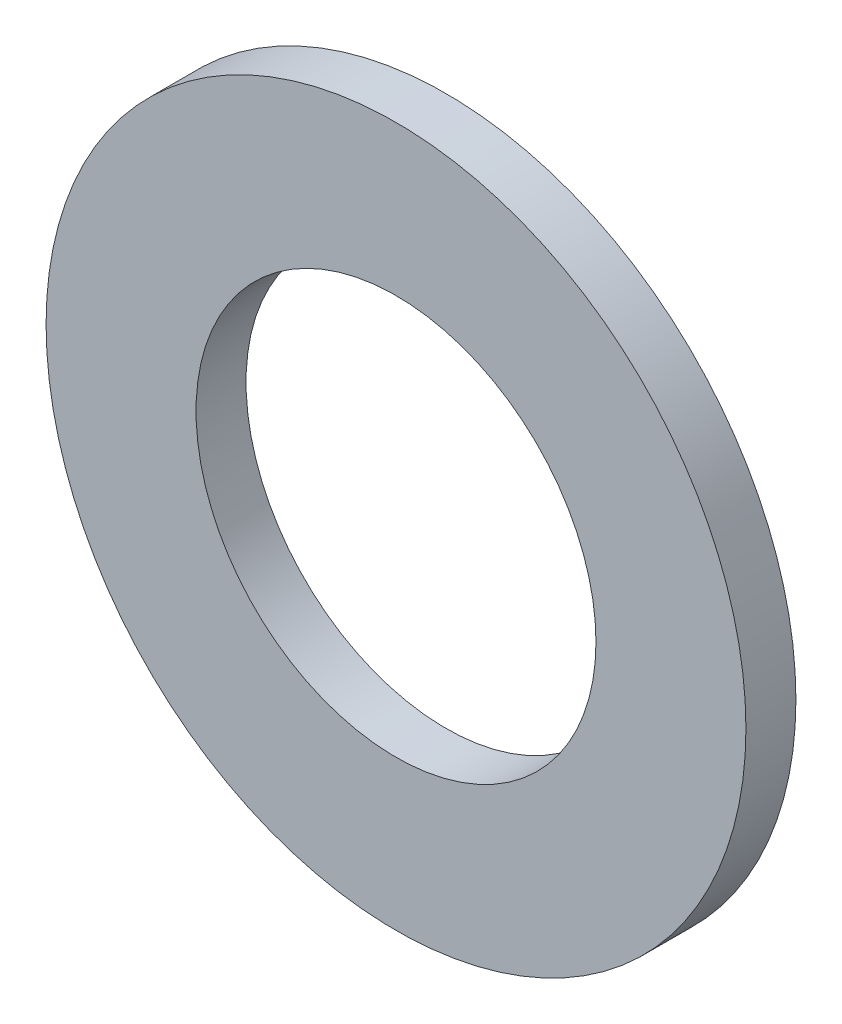
ISO-10303-21;
HEADER;
FILE_DESCRIPTION(('STEP AP214'),'2;1');
FILE_NAME('part.step','',(''),(''),'','','');
FILE_SCHEMA(('AUTOMOTIVE_DESIGN { 1 0 10303 214 1 1 1 1 }'));
ENDSEC;
DATA;
#1=APPLICATION_CONTEXT('core data for automotive mechanical design processes');
#2=APPLICATION_PROTOCOL_DEFINITION('international standard','automotive_design',2000,#1);
#3=PRODUCT_CONTEXT('',#1,'mechanical');
#4=PRODUCT('Part','Part','',(#3));
#5=PRODUCT_RELATED_PRODUCT_CATEGORY('part','',(#4));
#6=PRODUCT_DEFINITION_FORMATION('','',#4);
#7=PRODUCT_DEFINITION_CONTEXT('part definition',#1,'design');
#8=PRODUCT_DEFINITION('design','',#6,#7);
#9=PRODUCT_DEFINITION_SHAPE('','',#8);
#10=(LENGTH_UNIT() NAMED_UNIT(*) SI_UNIT(.MILLI.,.METRE.));
#11=(NAMED_UNIT(*) PLANE_ANGLE_UNIT() SI_UNIT($,.RADIAN.));
#12=(NAMED_UNIT(*) SI_UNIT($,.STERADIAN.) SOLID_ANGLE_UNIT());
#13=UNCERTAINTY_MEASURE_WITH_UNIT(LENGTH_MEASURE(1.E-05),#10,'distance_accuracy_value','');
#14=(GEOMETRIC_REPRESENTATION_CONTEXT(3) GLOBAL_UNCERTAINTY_ASSIGNED_CONTEXT((#13)) GLOBAL_UNIT_ASSIGNED_CONTEXT((#10,
#11,#12)) REPRESENTATION_CONTEXT('',''));
#15=CARTESIAN_POINT('',(0.,0.,0.));
#16=DIRECTION('',(0.,0.,1.));
#17=DIRECTION('',(1.,0.,0.));
#18=AXIS2_PLACEMENT_3D('',#15,#16,#17);
#19=CARTESIAN_POINT('',(0.,0.,0.));
#20=DIRECTION('',(0.,0.,1.));
#21=DIRECTION('',(1.,0.,0.));
#22=AXIS2_PLACEMENT_3D('',#19,#20,#21);
#23=PLANE('',#22);
#24=CARTESIAN_POINT('',(0.,0.,0.));
#25=DIRECTION('',(0.,0.,1.));
#26=DIRECTION('',(1.,0.,0.));
#27=AXIS2_PLACEMENT_3D('',#24,#25,#26);
#28=CIRCLE('',#27,4.);
#29=CARTESIAN_POINT('',(4.,0.,0.));
#30=VERTEX_POINT('',#29);
#31=EDGE_CURVE('E26',#30,#30,#28,.T.);
#32=ORIENTED_EDGE('',*,*,#31,.T.);
#33=EDGE_LOOP('',(#32));
#34=FACE_BOUND('',#33,.T.);
#35=CARTESIAN_POINT('',(0.,0.,0.));
#36=DIRECTION('',(0.,0.,1.));
#37=DIRECTION('',(1.,0.,0.));
#38=AXIS2_PLACEMENT_3D('',#35,#36,#37);
#39=CIRCLE('',#38,6.99999999999999);
#40=CARTESIAN_POINT('',(6.99999999999999,0.,0.));
#41=VERTEX_POINT('',#40);
#42=EDGE_CURVE('E17',#41,#41,#39,.T.);
#43=ORIENTED_EDGE('',*,*,#42,.F.);
#44=EDGE_LOOP('',(#43));
#45=FACE_BOUND('',#44,.T.);
#46=ADVANCED_FACE('F14',(#34,#45),#23,.F.);
#47=CARTESIAN_POINT('',(0.,0.,0.));
#48=DIRECTION('',(0.,0.,1.));
#49=DIRECTION('',(1.,0.,0.));
#50=AXIS2_PLACEMENT_3D('',#47,#48,#49);
#51=CYLINDRICAL_SURFACE('',#50,6.99999999999999);
#52=ORIENTED_EDGE('',*,*,#42,.T.);
#53=EDGE_LOOP('',(#52));
#54=FACE_BOUND('',#53,.T.);
#55=CARTESIAN_POINT('',(0.,0.,1.));
#56=DIRECTION('',(0.,0.,1.));
#57=DIRECTION('',(1.,0.,0.));
#58=AXIS2_PLACEMENT_3D('',#55,#56,#57);
#59=CIRCLE('',#58,6.99999999999999);
#60=CARTESIAN_POINT('',(6.99999999999999,0.,1.));
#61=VERTEX_POINT('',#60);
#62=EDGE_CURVE('E21',#61,#61,#59,.T.);
#63=ORIENTED_EDGE('',*,*,#62,.F.);
#64=EDGE_LOOP('',(#63));
#65=FACE_BOUND('',#64,.T.);
#66=ADVANCED_FACE('F34',(#54,#65),#51,.T.);
#67=CARTESIAN_POINT('',(0.,0.,0.));
#68=DIRECTION('',(0.,0.,1.));
#69=DIRECTION('',(1.,0.,0.));
#70=AXIS2_PLACEMENT_3D('',#67,#68,#69);
#71=CYLINDRICAL_SURFACE('',#70,4.);
#72=ORIENTED_EDGE('',*,*,#31,.F.);
#73=EDGE_LOOP('',(#72));
#74=FACE_BOUND('',#73,.T.);
#75=CARTESIAN_POINT('',(0.,0.,1.));
#76=DIRECTION('',(0.,0.,1.));
#77=DIRECTION('',(1.,0.,0.));
#78=AXIS2_PLACEMENT_3D('',#75,#76,#77);
#79=CIRCLE('',#78,4.);
#80=CARTESIAN_POINT('',(4.,0.,1.));
#81=VERTEX_POINT('',#80);
#82=EDGE_CURVE('E10',#81,#81,#79,.F.);
#83=ORIENTED_EDGE('',*,*,#82,.F.);
#84=EDGE_LOOP('',(#83));
#85=FACE_BOUND('',#84,.T.);
#86=ADVANCED_FACE('F42',(#74,#85),#71,.F.);
#87=CARTESIAN_POINT('',(0.,0.,1.));
#88=DIRECTION('',(0.,0.,1.));
#89=DIRECTION('',(1.,0.,0.));
#90=AXIS2_PLACEMENT_3D('',#87,#88,#89);
#91=PLANE('',#90);
#92=ORIENTED_EDGE('',*,*,#82,.T.);
#93=EDGE_LOOP('',(#92));
#94=FACE_BOUND('',#93,.T.);
#95=ORIENTED_EDGE('',*,*,#62,.T.);
#96=EDGE_LOOP('',(#95));
#97=FACE_BOUND('',#96,.T.);
#98=ADVANCED_FACE('F43',(#94,#97),#91,.T.);
#99=CLOSED_SHELL('',(#46,#66,#86,#98));
#100=MANIFOLD_SOLID_BREP('B1',#99);
#101=ADVANCED_BREP_SHAPE_REPRESENTATION('',(#18,#100),#14);
#102=SHAPE_DEFINITION_REPRESENTATION(#9,#101);
ENDSEC;
END-ISO-10303-21;
